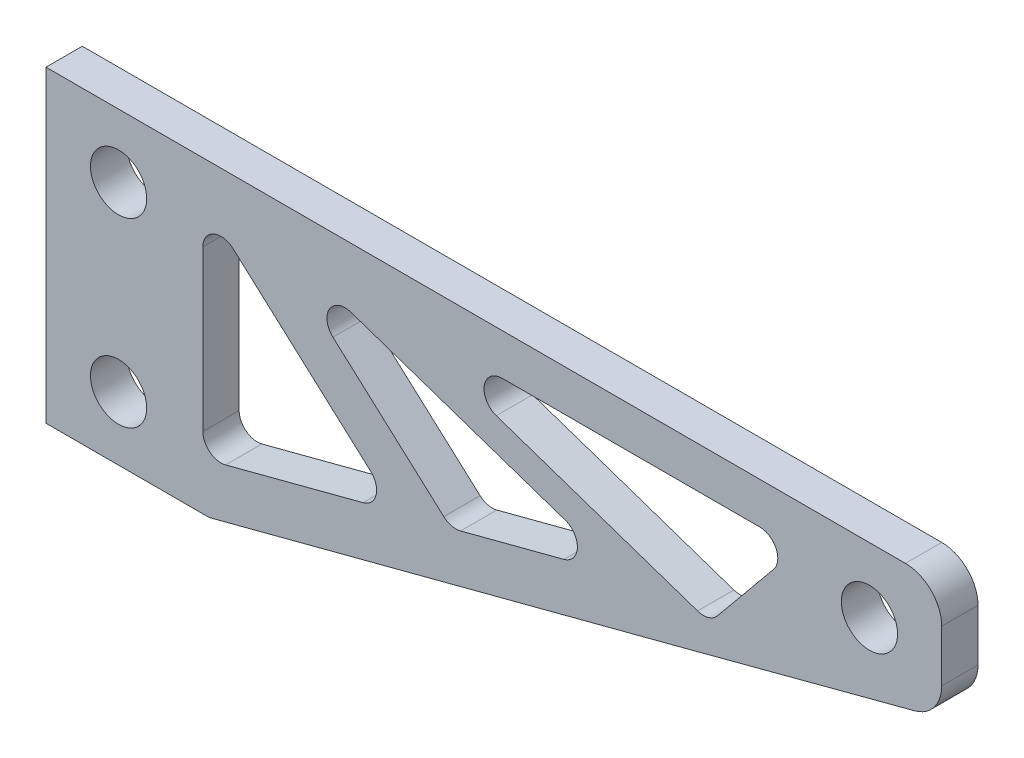
ISO-10303-21;
HEADER;
FILE_DESCRIPTION(('STEP AP214'),'2;1');
FILE_NAME('part.step','',(''),(''),'','','');
FILE_SCHEMA(('AUTOMOTIVE_DESIGN { 1 0 10303 214 1 1 1 1 }'));
ENDSEC;
DATA;
#1=APPLICATION_CONTEXT('core data for automotive mechanical design processes');
#2=APPLICATION_PROTOCOL_DEFINITION('international standard','automotive_design',2000,#1);
#3=PRODUCT_CONTEXT('',#1,'mechanical');
#4=PRODUCT('Part','Part','',(#3));
#5=PRODUCT_RELATED_PRODUCT_CATEGORY('part','',(#4));
#6=PRODUCT_DEFINITION_FORMATION('','',#4);
#7=PRODUCT_DEFINITION_CONTEXT('part definition',#1,'design');
#8=PRODUCT_DEFINITION('design','',#6,#7);
#9=PRODUCT_DEFINITION_SHAPE('','',#8);
#10=(LENGTH_UNIT() NAMED_UNIT(*) SI_UNIT(.MILLI.,.METRE.));
#11=(NAMED_UNIT(*) PLANE_ANGLE_UNIT() SI_UNIT($,.RADIAN.));
#12=(NAMED_UNIT(*) SI_UNIT($,.STERADIAN.) SOLID_ANGLE_UNIT());
#13=UNCERTAINTY_MEASURE_WITH_UNIT(LENGTH_MEASURE(1.E-05),#10,'distance_accuracy_value','');
#14=(GEOMETRIC_REPRESENTATION_CONTEXT(3) GLOBAL_UNCERTAINTY_ASSIGNED_CONTEXT((#13)) GLOBAL_UNIT_ASSIGNED_CONTEXT((#10,
#11,#12)) REPRESENTATION_CONTEXT('',''));
#15=CARTESIAN_POINT('',(0.,0.,0.));
#16=DIRECTION('',(0.,0.,1.));
#17=DIRECTION('',(1.,0.,0.));
#18=AXIS2_PLACEMENT_3D('',#15,#16,#17);
#19=CARTESIAN_POINT('',(42.8741564619006,5.14965167359102,2.));
#20=DIRECTION('',(0.,0.,-1.));
#21=DIRECTION('',(-1.,0.,0.));
#22=AXIS2_PLACEMENT_3D('',#19,#20,#21);
#23=PLANE('',#22);
#24=CARTESIAN_POINT('',(18.096822350734,0.252098862884251,2.));
#25=DIRECTION('',(0.,0.,1.));
#26=DIRECTION('',(1.,0.,0.));
#27=AXIS2_PLACEMENT_3D('',#24,#25,#26);
#28=CIRCLE('',#27,1.);
#29=CARTESIAN_POINT('',(17.4273653112307,-0.490751910999393,2.));
#30=VERTEX_POINT('',#29);
#31=CARTESIAN_POINT('',(18.3503103898361,-0.715239658023577,2.));
#32=VERTEX_POINT('',#31);
#33=EDGE_CURVE('E286',#30,#32,#28,.T.);
#34=ORIENTED_EDGE('',*,*,#33,.F.);
#35=DIRECTION('',(0.742850773883642,-0.669457039503264,0.));
#36=VECTOR('',#35,1.);
#37=CARTESIAN_POINT('',(11.3156214316606,5.0171510321832,2.));
#38=LINE('',#37,#36);
#39=CARTESIAN_POINT('',(11.3156214316606,5.01715103218319,2.));
#40=VERTEX_POINT('',#39);
#41=EDGE_CURVE('E303',#40,#30,#38,.T.);
#42=ORIENTED_EDGE('',*,*,#41,.F.);
#43=CARTESIAN_POINT('',(11.9850784711639,5.76000180606684,2.));
#44=DIRECTION('',(0.,0.,1.));
#45=DIRECTION('',(1.,0.,0.));
#46=AXIS2_PLACEMENT_3D('',#43,#44,#45);
#47=CIRCLE('',#46,1.);
#48=CARTESIAN_POINT('',(12.3070543121374,6.70674969110773,2.));
#49=VERTEX_POINT('',#48);
#50=EDGE_CURVE('E299',#49,#40,#47,.T.);
#51=ORIENTED_EDGE('',*,*,#50,.F.);
#52=DIRECTION('',(-0.946747885040891,0.321975840973511,0.));
#53=VECTOR('',#52,1.);
#54=CARTESIAN_POINT('',(24.1141900201502,2.69130639396048,2.));
#55=LINE('',#54,#53);
#56=CARTESIAN_POINT('',(24.1141900201502,2.69130639396048,2.));
#57=VERTEX_POINT('',#56);
#58=EDGE_CURVE('E296',#57,#49,#55,.T.);
#59=ORIENTED_EDGE('',*,*,#58,.F.);
#60=CARTESIAN_POINT('',(23.7922141791767,1.74455850891959,2.));
#61=DIRECTION('',(0.,0.,1.));
#62=DIRECTION('',(1.,0.,0.));
#63=AXIS2_PLACEMENT_3D('',#60,#61,#62);
#64=CIRCLE('',#63,1.);
#65=CARTESIAN_POINT('',(24.0457022182789,0.777219988011759,2.));
#66=VERTEX_POINT('',#65);
#67=EDGE_CURVE('E293',#66,#57,#64,.T.);
#68=ORIENTED_EDGE('',*,*,#67,.F.);
#69=DIRECTION('',(0.967338520907825,0.253488039102164,0.));
#70=VECTOR('',#69,1.);
#71=CARTESIAN_POINT('',(18.3503103898361,-0.715239658023577,2.));
#72=LINE('',#71,#70);
#73=EDGE_CURVE('E289',#32,#66,#72,.T.);
#74=ORIENTED_EDGE('',*,*,#73,.F.);
#75=EDGE_LOOP('',(#34,#42,#51,#59,#68,#74));
#76=FACE_BOUND('',#75,.T.);
#77=CARTESIAN_POINT('',(40.8905891871686,6.41133605295591,2.));
#78=DIRECTION('',(0.,0.,1.));
#79=DIRECTION('',(1.,0.,0.));
#80=AXIS2_PLACEMENT_3D('',#77,#78,#79);
#81=CIRCLE('',#80,1.55);
#82=CARTESIAN_POINT('',(42.4405891871686,6.41133605295591,2.));
#83=VERTEX_POINT('',#82);
#84=EDGE_CURVE('E412',#83,#83,#81,.T.);
#85=ORIENTED_EDGE('',*,*,#84,.F.);
#86=EDGE_LOOP('',(#85));
#87=FACE_BOUND('',#86,.T.);
#88=CARTESIAN_POINT('',(-0.499999999999998,6.5,2.));
#89=DIRECTION('',(0.,0.,1.));
#90=DIRECTION('',(-1.,0.,0.));
#91=AXIS2_PLACEMENT_3D('',#88,#89,#90);
#92=CIRCLE('',#91,1.55);
#93=CARTESIAN_POINT('',(-2.05,6.5,2.));
#94=VERTEX_POINT('',#93);
#95=EDGE_CURVE('E420',#94,#94,#92,.T.);
#96=ORIENTED_EDGE('',*,*,#95,.F.);
#97=EDGE_LOOP('',(#96));
#98=FACE_BOUND('',#97,.T.);
#99=CARTESIAN_POINT('',(-0.499999999999997,-3.5,2.));
#100=DIRECTION('',(0.,0.,1.));
#101=DIRECTION('',(1.,0.,0.));
#102=AXIS2_PLACEMENT_3D('',#99,#100,#101);
#103=CIRCLE('',#102,1.55);
#104=CARTESIAN_POINT('',(1.05,-3.5,2.));
#105=VERTEX_POINT('',#104);
#106=EDGE_CURVE('E428',#105,#105,#103,.T.);
#107=ORIENTED_EDGE('',*,*,#106,.F.);
#108=EDGE_LOOP('',(#107));
#109=FACE_BOUND('',#108,.T.);
#110=DIRECTION('',(0.,-1.,0.));
#111=VECTOR('',#110,1.);
#112=CARTESIAN_POINT('',(-4.5,10.,2.));
#113=LINE('',#112,#111);
#114=CARTESIAN_POINT('',(-4.5,10.,2.));
#115=VERTEX_POINT('',#114);
#116=CARTESIAN_POINT('',(-4.5,-7.,2.));
#117=VERTEX_POINT('',#116);
#118=EDGE_CURVE('E436',#115,#117,#113,.T.);
#119=ORIENTED_EDGE('',*,*,#118,.T.);
#120=DIRECTION('',(1.,0.,0.));
#121=VECTOR('',#120,1.);
#122=CARTESIAN_POINT('',(-4.5,-7.,2.));
#123=LINE('',#122,#121);
#124=CARTESIAN_POINT('',(4.50000000000001,-7.,2.));
#125=VERTEX_POINT('',#124);
#126=EDGE_CURVE('E440',#117,#125,#123,.T.);
#127=ORIENTED_EDGE('',*,*,#126,.T.);
#128=DIRECTION('',(0.967338520907825,0.253488039102165,0.));
#129=VECTOR('',#128,1.);
#130=CARTESIAN_POINT('',(4.50000000000001,-7.,2.));
#131=LINE('',#130,#129);
#132=CARTESIAN_POINT('',(31.2127777323871,0.,2.));
#133=VERTEX_POINT('',#132);
#134=EDGE_CURVE('E444',#125,#133,#131,.T.);
#135=ORIENTED_EDGE('',*,*,#134,.T.);
#136=DIRECTION('',(0.966824322874882,0.255442221837984,0.));
#137=VECTOR('',#136,1.);
#138=CARTESIAN_POINT('',(31.2127777323871,0.,2.));
#139=LINE('',#138,#137);
#140=CARTESIAN_POINT('',(43.3850409055766,3.21600302784125,2.));
#141=VERTEX_POINT('',#140);
#142=EDGE_CURVE('E447',#133,#141,#139,.T.);
#143=ORIENTED_EDGE('',*,*,#142,.T.);
#144=CARTESIAN_POINT('',(42.8741564619006,5.14965167359102,2.));
#145=DIRECTION('',(0.,0.,1.));
#146=DIRECTION('',(-1.,0.,0.));
#147=AXIS2_PLACEMENT_3D('',#144,#145,#146);
#148=CIRCLE('',#147,2.);
#149=CARTESIAN_POINT('',(44.8741564619006,5.14965167359102,2.));
#150=VERTEX_POINT('',#149);
#151=EDGE_CURVE('E450',#141,#150,#148,.T.);
#152=ORIENTED_EDGE('',*,*,#151,.T.);
#153=DIRECTION('',(0.,1.,0.));
#154=VECTOR('',#153,1.);
#155=CARTESIAN_POINT('',(44.8741564619006,8.,2.));
#156=LINE('',#155,#154);
#157=CARTESIAN_POINT('',(44.8741564619006,8.,2.));
#158=VERTEX_POINT('',#157);
#159=EDGE_CURVE('E453',#150,#158,#156,.T.);
#160=ORIENTED_EDGE('',*,*,#159,.T.);
#161=CARTESIAN_POINT('',(42.8741564619006,8.,2.));
#162=DIRECTION('',(0.,0.,1.));
#163=DIRECTION('',(1.,0.,0.));
#164=AXIS2_PLACEMENT_3D('',#161,#162,#163);
#165=CIRCLE('',#164,2.);
#166=CARTESIAN_POINT('',(42.8741564619006,10.,2.));
#167=VERTEX_POINT('',#166);
#168=EDGE_CURVE('E456',#158,#167,#165,.T.);
#169=ORIENTED_EDGE('',*,*,#168,.T.);
#170=DIRECTION('',(-1.,0.,0.));
#171=VECTOR('',#170,1.);
#172=CARTESIAN_POINT('',(4.5,10.,2.));
#173=LINE('',#172,#171);
#174=EDGE_CURVE('E459',#167,#115,#173,.T.);
#175=ORIENTED_EDGE('',*,*,#174,.T.);
#176=EDGE_LOOP('',(#119,#127,#135,#143,#152,#160,#169,#175));
#177=FACE_BOUND('',#176,.T.);
#178=CARTESIAN_POINT('',(31.739490278292,2.94677227113637,2.));
#179=DIRECTION('',(0.,0.,1.));
#180=DIRECTION('',(1.,0.,0.));
#181=AXIS2_PLACEMENT_3D('',#178,#179,#180);
#182=CIRCLE('',#181,0.999999999999999);
#183=CARTESIAN_POINT('',(31.4175144373185,2.00002438609548,2.));
#184=VERTEX_POINT('',#183);
#185=CARTESIAN_POINT('',(32.5122936708471,2.31212676657856,2.));
#186=VERTEX_POINT('',#185);
#187=EDGE_CURVE('E349',#184,#186,#182,.T.);
#188=ORIENTED_EDGE('',*,*,#187,.F.);
#189=DIRECTION('',(0.946747885040891,-0.32197584097351,0.));
#190=VECTOR('',#189,1.);
#191=CARTESIAN_POINT('',(20.3215878771777,5.77359530400396,2.));
#192=LINE('',#191,#190);
#193=CARTESIAN_POINT('',(20.3215878771777,5.77359530400396,2.));
#194=VERTEX_POINT('',#193);
#195=EDGE_CURVE('E366',#194,#184,#192,.T.);
#196=ORIENTED_EDGE('',*,*,#195,.F.);
#197=CARTESIAN_POINT('',(20.6435637181512,6.72034318904485,2.));
#198=DIRECTION('',(0.,0.,1.));
#199=DIRECTION('',(1.,0.,0.));
#200=AXIS2_PLACEMENT_3D('',#197,#198,#199);
#201=CIRCLE('',#200,1.);
#202=CARTESIAN_POINT('',(20.6435637181512,7.72034318904485,2.));
#203=VERTEX_POINT('',#202);
#204=EDGE_CURVE('E362',#203,#194,#201,.T.);
#205=ORIENTED_EDGE('',*,*,#204,.F.);
#206=DIRECTION('',(-1.,0.,0.));
#207=VECTOR('',#206,1.);
#208=CARTESIAN_POINT('',(34.8384412433788,7.72034318904485,2.));
#209=LINE('',#208,#207);
#210=CARTESIAN_POINT('',(34.8384412433788,7.72034318904485,2.));
#211=VERTEX_POINT('',#210);
#212=EDGE_CURVE('E359',#211,#203,#209,.T.);
#213=ORIENTED_EDGE('',*,*,#212,.F.);
#214=CARTESIAN_POINT('',(34.8384412433788,6.72034318904485,2.));
#215=DIRECTION('',(0.,0.,1.));
#216=DIRECTION('',(1.,0.,0.));
#217=AXIS2_PLACEMENT_3D('',#214,#215,#216);
#218=CIRCLE('',#217,0.999999999999998);
#219=CARTESIAN_POINT('',(35.6112446359338,6.08569768448704,2.));
#220=VERTEX_POINT('',#219);
#221=EDGE_CURVE('E356',#220,#211,#218,.T.);
#222=ORIENTED_EDGE('',*,*,#221,.F.);
#223=DIRECTION('',(0.634645504557812,0.772803392555028,0.));
#224=VECTOR('',#223,1.);
#225=CARTESIAN_POINT('',(32.5122936708471,2.31212676657856,2.));
#226=LINE('',#225,#224);
#227=EDGE_CURVE('E352',#186,#220,#226,.T.);
#228=ORIENTED_EDGE('',*,*,#227,.F.);
#229=EDGE_LOOP('',(#188,#196,#205,#213,#222,#228));
#230=FACE_BOUND('',#229,.T.);
#231=CARTESIAN_POINT('',(12.7242198609319,-1.0839637074037,2.));
#232=DIRECTION('',(0.,0.,1.));
#233=DIRECTION('',(1.,0.,0.));
#234=AXIS2_PLACEMENT_3D('',#231,#232,#233);
#235=CIRCLE('',#234,1.);
#236=CARTESIAN_POINT('',(12.9777079000341,-2.05130222831152,2.));
#237=VERTEX_POINT('',#236);
#238=CARTESIAN_POINT('',(13.3936769004352,-0.341112933520051,2.));
#239=VERTEX_POINT('',#238);
#240=EDGE_CURVE('E217',#237,#239,#235,.T.);
#241=ORIENTED_EDGE('',*,*,#240,.F.);
#242=DIRECTION('',(0.967338520907825,0.253488039102165,0.));
#243=VECTOR('',#242,1.);
#244=CARTESIAN_POINT('',(5.39999478244817,-4.03701829103269,2.));
#245=LINE('',#244,#243);
#246=CARTESIAN_POINT('',(5.39999478244817,-4.03701829103269,2.));
#247=VERTEX_POINT('',#246);
#248=EDGE_CURVE('E252',#247,#237,#245,.T.);
#249=ORIENTED_EDGE('',*,*,#248,.F.);
#250=CARTESIAN_POINT('',(5.146506743346,-3.06967977012486,2.));
#251=DIRECTION('',(0.,0.,1.));
#252=DIRECTION('',(1.,0.,0.));
#253=AXIS2_PLACEMENT_3D('',#250,#251,#252);
#254=CIRCLE('',#253,1.);
#255=CARTESIAN_POINT('',(4.146506743346,-3.06967977012486,2.));
#256=VERTEX_POINT('',#255);
#257=EDGE_CURVE('E249',#256,#247,#254,.T.);
#258=ORIENTED_EDGE('',*,*,#257,.F.);
#259=DIRECTION('',(0.,-1.,0.));
#260=VECTOR('',#259,1.);
#261=CARTESIAN_POINT('',(4.146506743346,5.7450705593072,2.));
#262=LINE('',#261,#260);
#263=CARTESIAN_POINT('',(4.146506743346,5.7450705593072,2.));
#264=VERTEX_POINT('',#263);
#265=EDGE_CURVE('E244',#264,#256,#262,.T.);
#266=ORIENTED_EDGE('',*,*,#265,.F.);
#267=CARTESIAN_POINT('',(5.146506743346,5.74507055930722,2.));
#268=DIRECTION('',(0.,0.,1.));
#269=DIRECTION('',(1.,0.,0.));
#270=AXIS2_PLACEMENT_3D('',#267,#268,#269);
#271=CIRCLE('',#270,1.);
#272=CARTESIAN_POINT('',(5.81596378284927,6.48792133319086,2.));
#273=VERTEX_POINT('',#272);
#274=EDGE_CURVE('E240',#273,#264,#271,.T.);
#275=ORIENTED_EDGE('',*,*,#274,.F.);
#276=DIRECTION('',(-0.742850773883641,0.669457039503264,0.));
#277=VECTOR('',#276,1.);
#278=CARTESIAN_POINT('',(13.3936769004352,-0.341112933520051,2.));
#279=LINE('',#278,#277);
#280=EDGE_CURVE('E226',#239,#273,#279,.T.);
#281=ORIENTED_EDGE('',*,*,#280,.F.);
#282=EDGE_LOOP('',(#241,#249,#258,#266,#275,#281));
#283=FACE_BOUND('',#282,.T.);
#284=ADVANCED_FACE('F43',(#76,#87,#98,#109,#177,#230,#283),#23,.F.);
#285=CARTESIAN_POINT('',(42.8741564619006,5.14965167359102,0.));
#286=DIRECTION('',(0.,0.,-1.));
#287=DIRECTION('',(-1.,0.,0.));
#288=AXIS2_PLACEMENT_3D('',#285,#286,#287);
#289=PLANE('',#288);
#290=CARTESIAN_POINT('',(-0.499999999999998,6.5,0.));
#291=DIRECTION('',(0.,0.,1.));
#292=DIRECTION('',(-1.,0.,0.));
#293=AXIS2_PLACEMENT_3D('',#290,#291,#292);
#294=CIRCLE('',#293,1.55);
#295=CARTESIAN_POINT('',(-2.05,6.5,0.));
#296=VERTEX_POINT('',#295);
#297=EDGE_CURVE('E416',#296,#296,#294,.T.);
#298=ORIENTED_EDGE('',*,*,#297,.T.);
#299=EDGE_LOOP('',(#298));
#300=FACE_BOUND('',#299,.T.);
#301=DIRECTION('',(0.,-1.,0.));
#302=VECTOR('',#301,1.);
#303=CARTESIAN_POINT('',(-4.5,10.,0.));
#304=LINE('',#303,#302);
#305=CARTESIAN_POINT('',(-4.5,10.,0.));
#306=VERTEX_POINT('',#305);
#307=CARTESIAN_POINT('',(-4.5,-7.,0.));
#308=VERTEX_POINT('',#307);
#309=EDGE_CURVE('E432',#306,#308,#304,.T.);
#310=ORIENTED_EDGE('',*,*,#309,.F.);
#311=DIRECTION('',(-1.,0.,0.));
#312=VECTOR('',#311,1.);
#313=CARTESIAN_POINT('',(-4.5,10.,0.));
#314=LINE('',#313,#312);
#315=CARTESIAN_POINT('',(42.8741564619006,10.,0.));
#316=VERTEX_POINT('',#315);
#317=EDGE_CURVE('E441',#316,#306,#314,.T.);
#318=ORIENTED_EDGE('',*,*,#317,.F.);
#319=CARTESIAN_POINT('',(42.8741564619006,8.,0.));
#320=DIRECTION('',(0.,0.,1.));
#321=DIRECTION('',(1.,0.,0.));
#322=AXIS2_PLACEMENT_3D('',#319,#320,#321);
#323=CIRCLE('',#322,2.);
#324=CARTESIAN_POINT('',(44.8741564619006,8.,0.));
#325=VERTEX_POINT('',#324);
#326=EDGE_CURVE('E481',#325,#316,#323,.T.);
#327=ORIENTED_EDGE('',*,*,#326,.F.);
#328=DIRECTION('',(0.,1.,0.));
#329=VECTOR('',#328,1.);
#330=CARTESIAN_POINT('',(44.8741564619006,8.,0.));
#331=LINE('',#330,#329);
#332=CARTESIAN_POINT('',(44.8741564619006,5.14965167359102,0.));
#333=VERTEX_POINT('',#332);
#334=EDGE_CURVE('E478',#333,#325,#331,.T.);
#335=ORIENTED_EDGE('',*,*,#334,.F.);
#336=CARTESIAN_POINT('',(42.8741564619006,5.14965167359102,0.));
#337=DIRECTION('',(0.,0.,1.));
#338=DIRECTION('',(-1.,0.,0.));
#339=AXIS2_PLACEMENT_3D('',#336,#337,#338);
#340=CIRCLE('',#339,2.);
#341=CARTESIAN_POINT('',(43.3850409055766,3.21600302784125,0.));
#342=VERTEX_POINT('',#341);
#343=EDGE_CURVE('E475',#342,#333,#340,.T.);
#344=ORIENTED_EDGE('',*,*,#343,.F.);
#345=DIRECTION('',(0.966824322874882,0.255442221837984,0.));
#346=VECTOR('',#345,1.);
#347=CARTESIAN_POINT('',(31.2127777323871,0.,0.));
#348=LINE('',#347,#346);
#349=CARTESIAN_POINT('',(31.2127777323871,0.,0.));
#350=VERTEX_POINT('',#349);
#351=EDGE_CURVE('E472',#350,#342,#348,.T.);
#352=ORIENTED_EDGE('',*,*,#351,.F.);
#353=DIRECTION('',(0.967338520907825,0.253488039102165,0.));
#354=VECTOR('',#353,1.);
#355=CARTESIAN_POINT('',(4.50000000000001,-7.,0.));
#356=LINE('',#355,#354);
#357=CARTESIAN_POINT('',(4.50000000000001,-7.,0.));
#358=VERTEX_POINT('',#357);
#359=EDGE_CURVE('E469',#358,#350,#356,.T.);
#360=ORIENTED_EDGE('',*,*,#359,.F.);
#361=DIRECTION('',(1.,0.,0.));
#362=VECTOR('',#361,1.);
#363=CARTESIAN_POINT('',(-4.5,-7.,0.));
#364=LINE('',#363,#362);
#365=EDGE_CURVE('E466',#308,#358,#364,.T.);
#366=ORIENTED_EDGE('',*,*,#365,.F.);
#367=EDGE_LOOP('',(#310,#318,#327,#335,#344,#352,#360,#366));
#368=FACE_BOUND('',#367,.T.);
#369=CARTESIAN_POINT('',(-0.499999999999997,-3.5,0.));
#370=DIRECTION('',(0.,0.,1.));
#371=DIRECTION('',(1.,0.,0.));
#372=AXIS2_PLACEMENT_3D('',#369,#370,#371);
#373=CIRCLE('',#372,1.55);
#374=CARTESIAN_POINT('',(1.05,-3.5,0.));
#375=VERTEX_POINT('',#374);
#376=EDGE_CURVE('E424',#375,#375,#373,.T.);
#377=ORIENTED_EDGE('',*,*,#376,.T.);
#378=EDGE_LOOP('',(#377));
#379=FACE_BOUND('',#378,.T.);
#380=CARTESIAN_POINT('',(40.8905891871686,6.41133605295591,0.));
#381=DIRECTION('',(0.,0.,1.));
#382=DIRECTION('',(1.,0.,0.));
#383=AXIS2_PLACEMENT_3D('',#380,#381,#382);
#384=CIRCLE('',#383,1.55);
#385=CARTESIAN_POINT('',(42.4405891871686,6.41133605295591,0.));
#386=VERTEX_POINT('',#385);
#387=EDGE_CURVE('E411',#386,#386,#384,.T.);
#388=ORIENTED_EDGE('',*,*,#387,.T.);
#389=EDGE_LOOP('',(#388));
#390=FACE_BOUND('',#389,.T.);
#391=DIRECTION('',(0.946747885040891,-0.32197584097351,0.));
#392=VECTOR('',#391,1.);
#393=CARTESIAN_POINT('',(20.3215878771777,5.77359530400396,0.));
#394=LINE('',#393,#392);
#395=CARTESIAN_POINT('',(20.3215878771777,5.77359530400396,0.));
#396=VERTEX_POINT('',#395);
#397=CARTESIAN_POINT('',(31.4175144373185,2.00002438609548,0.));
#398=VERTEX_POINT('',#397);
#399=EDGE_CURVE('E353',#396,#398,#394,.T.);
#400=ORIENTED_EDGE('',*,*,#399,.T.);
#401=CARTESIAN_POINT('',(31.739490278292,2.94677227113637,0.));
#402=DIRECTION('',(0.,0.,1.));
#403=DIRECTION('',(1.,0.,0.));
#404=AXIS2_PLACEMENT_3D('',#401,#402,#403);
#405=CIRCLE('',#404,0.999999999999999);
#406=CARTESIAN_POINT('',(32.5122936708471,2.31212676657856,0.));
#407=VERTEX_POINT('',#406);
#408=EDGE_CURVE('E348',#398,#407,#405,.T.);
#409=ORIENTED_EDGE('',*,*,#408,.T.);
#410=DIRECTION('',(0.634645504557812,0.772803392555028,0.));
#411=VECTOR('',#410,1.);
#412=CARTESIAN_POINT('',(32.5122936708471,2.31212676657856,0.));
#413=LINE('',#412,#411);
#414=CARTESIAN_POINT('',(35.6112446359338,6.08569768448704,0.));
#415=VERTEX_POINT('',#414);
#416=EDGE_CURVE('E373',#407,#415,#413,.T.);
#417=ORIENTED_EDGE('',*,*,#416,.T.);
#418=CARTESIAN_POINT('',(34.8384412433788,6.72034318904485,0.));
#419=DIRECTION('',(0.,0.,1.));
#420=DIRECTION('',(1.,0.,0.));
#421=AXIS2_PLACEMENT_3D('',#418,#419,#420);
#422=CIRCLE('',#421,0.999999999999998);
#423=CARTESIAN_POINT('',(34.8384412433788,7.72034318904485,0.));
#424=VERTEX_POINT('',#423);
#425=EDGE_CURVE('E377',#415,#424,#422,.T.);
#426=ORIENTED_EDGE('',*,*,#425,.T.);
#427=DIRECTION('',(-1.,0.,0.));
#428=VECTOR('',#427,1.);
#429=CARTESIAN_POINT('',(34.8384412433788,7.72034318904485,0.));
#430=LINE('',#429,#428);
#431=CARTESIAN_POINT('',(20.6435637181512,7.72034318904485,0.));
#432=VERTEX_POINT('',#431);
#433=EDGE_CURVE('E381',#424,#432,#430,.T.);
#434=ORIENTED_EDGE('',*,*,#433,.T.);
#435=CARTESIAN_POINT('',(20.6435637181512,6.72034318904485,0.));
#436=DIRECTION('',(0.,0.,1.));
#437=DIRECTION('',(1.,0.,0.));
#438=AXIS2_PLACEMENT_3D('',#435,#436,#437);
#439=CIRCLE('',#438,1.);
#440=EDGE_CURVE('E385',#432,#396,#439,.T.);
#441=ORIENTED_EDGE('',*,*,#440,.T.);
#442=EDGE_LOOP('',(#400,#409,#417,#426,#434,#441));
#443=FACE_BOUND('',#442,.T.);
#444=DIRECTION('',(0.742850773883642,-0.669457039503264,0.));
#445=VECTOR('',#444,1.);
#446=CARTESIAN_POINT('',(11.3156214316606,5.0171510321832,0.));
#447=LINE('',#446,#445);
#448=CARTESIAN_POINT('',(11.3156214316606,5.0171510321832,0.));
#449=VERTEX_POINT('',#448);
#450=CARTESIAN_POINT('',(17.4273653112307,-0.490751910999404,0.));
#451=VERTEX_POINT('',#450);
#452=EDGE_CURVE('E290',#449,#451,#447,.T.);
#453=ORIENTED_EDGE('',*,*,#452,.T.);
#454=CARTESIAN_POINT('',(18.096822350734,0.252098862884251,0.));
#455=DIRECTION('',(0.,0.,1.));
#456=DIRECTION('',(1.,0.,0.));
#457=AXIS2_PLACEMENT_3D('',#454,#455,#456);
#458=CIRCLE('',#457,1.);
#459=CARTESIAN_POINT('',(18.3503103898361,-0.715239658023577,0.));
#460=VERTEX_POINT('',#459);
#461=EDGE_CURVE('E235',#451,#460,#458,.T.);
#462=ORIENTED_EDGE('',*,*,#461,.T.);
#463=DIRECTION('',(0.967338520907825,0.253488039102164,0.));
#464=VECTOR('',#463,1.);
#465=CARTESIAN_POINT('',(18.3503103898361,-0.715239658023577,0.));
#466=LINE('',#465,#464);
#467=CARTESIAN_POINT('',(24.0457022182789,0.777219988011759,0.));
#468=VERTEX_POINT('',#467);
#469=EDGE_CURVE('E310',#460,#468,#466,.T.);
#470=ORIENTED_EDGE('',*,*,#469,.T.);
#471=CARTESIAN_POINT('',(23.7922141791767,1.74455850891959,0.));
#472=DIRECTION('',(0.,0.,1.));
#473=DIRECTION('',(1.,0.,0.));
#474=AXIS2_PLACEMENT_3D('',#471,#472,#473);
#475=CIRCLE('',#474,1.);
#476=CARTESIAN_POINT('',(24.1141900201502,2.69130639396048,0.));
#477=VERTEX_POINT('',#476);
#478=EDGE_CURVE('E314',#468,#477,#475,.T.);
#479=ORIENTED_EDGE('',*,*,#478,.T.);
#480=DIRECTION('',(-0.946747885040891,0.321975840973511,0.));
#481=VECTOR('',#480,1.);
#482=CARTESIAN_POINT('',(24.1141900201502,2.69130639396048,0.));
#483=LINE('',#482,#481);
#484=CARTESIAN_POINT('',(12.3070543121374,6.70674969110773,0.));
#485=VERTEX_POINT('',#484);
#486=EDGE_CURVE('E318',#477,#485,#483,.T.);
#487=ORIENTED_EDGE('',*,*,#486,.T.);
#488=CARTESIAN_POINT('',(11.9850784711639,5.76000180606684,0.));
#489=DIRECTION('',(0.,0.,1.));
#490=DIRECTION('',(1.,0.,0.));
#491=AXIS2_PLACEMENT_3D('',#488,#489,#490);
#492=CIRCLE('',#491,1.);
#493=EDGE_CURVE('E322',#485,#449,#492,.T.);
#494=ORIENTED_EDGE('',*,*,#493,.T.);
#495=EDGE_LOOP('',(#453,#462,#470,#479,#487,#494));
#496=FACE_BOUND('',#495,.T.);
#497=DIRECTION('',(0.967338520907825,0.253488039102165,0.));
#498=VECTOR('',#497,1.);
#499=CARTESIAN_POINT('',(5.39999478244817,-4.03701829103269,0.));
#500=LINE('',#499,#498);
#501=CARTESIAN_POINT('',(5.39999478244817,-4.03701829103269,0.));
#502=VERTEX_POINT('',#501);
#503=CARTESIAN_POINT('',(12.9777079000341,-2.05130222831152,0.));
#504=VERTEX_POINT('',#503);
#505=EDGE_CURVE('E227',#502,#504,#500,.T.);
#506=ORIENTED_EDGE('',*,*,#505,.T.);
#507=CARTESIAN_POINT('',(12.7242198609319,-1.0839637074037,0.));
#508=DIRECTION('',(0.,0.,1.));
#509=DIRECTION('',(1.,0.,0.));
#510=AXIS2_PLACEMENT_3D('',#507,#508,#509);
#511=CIRCLE('',#510,1.);
#512=CARTESIAN_POINT('',(13.3936769004352,-0.341112933520051,0.));
#513=VERTEX_POINT('',#512);
#514=EDGE_CURVE('E67',#504,#513,#511,.T.);
#515=ORIENTED_EDGE('',*,*,#514,.T.);
#516=DIRECTION('',(-0.742850773883641,0.669457039503264,0.));
#517=VECTOR('',#516,1.);
#518=CARTESIAN_POINT('',(13.3936769004352,-0.341112933520051,0.));
#519=LINE('',#518,#517);
#520=CARTESIAN_POINT('',(5.81596378284927,6.48792133319086,0.));
#521=VERTEX_POINT('',#520);
#522=EDGE_CURVE('E233',#513,#521,#519,.T.);
#523=ORIENTED_EDGE('',*,*,#522,.T.);
#524=CARTESIAN_POINT('',(5.146506743346,5.74507055930722,0.));
#525=DIRECTION('',(0.,0.,1.));
#526=DIRECTION('',(1.,0.,0.));
#527=AXIS2_PLACEMENT_3D('',#524,#525,#526);
#528=CIRCLE('',#527,1.);
#529=CARTESIAN_POINT('',(4.146506743346,5.7450705593072,0.));
#530=VERTEX_POINT('',#529);
#531=EDGE_CURVE('E259',#521,#530,#528,.T.);
#532=ORIENTED_EDGE('',*,*,#531,.T.);
#533=DIRECTION('',(0.,-1.,0.));
#534=VECTOR('',#533,1.);
#535=CARTESIAN_POINT('',(4.146506743346,5.7450705593072,0.));
#536=LINE('',#535,#534);
#537=CARTESIAN_POINT('',(4.146506743346,-3.06967977012486,0.));
#538=VERTEX_POINT('',#537);
#539=EDGE_CURVE('E263',#530,#538,#536,.T.);
#540=ORIENTED_EDGE('',*,*,#539,.T.);
#541=CARTESIAN_POINT('',(5.146506743346,-3.06967977012486,0.));
#542=DIRECTION('',(0.,0.,1.));
#543=DIRECTION('',(1.,0.,0.));
#544=AXIS2_PLACEMENT_3D('',#541,#542,#543);
#545=CIRCLE('',#544,1.);
#546=EDGE_CURVE('E267',#538,#502,#545,.T.);
#547=ORIENTED_EDGE('',*,*,#546,.T.);
#548=EDGE_LOOP('',(#506,#515,#523,#532,#540,#547));
#549=FACE_BOUND('',#548,.T.);
#550=ADVANCED_FACE('F521',(#300,#368,#379,#390,#443,#496,#549),#289,.T.);
#551=CARTESIAN_POINT('',(-4.5,10.,2.));
#552=DIRECTION('',(1.,0.,0.));
#553=DIRECTION('',(0.,1.,0.));
#554=AXIS2_PLACEMENT_3D('',#551,#552,#553);
#555=PLANE('',#554);
#556=ORIENTED_EDGE('',*,*,#309,.T.);
#557=DIRECTION('',(0.,0.,-1.));
#558=VECTOR('',#557,1.);
#559=CARTESIAN_POINT('',(-4.5,-7.,2.));
#560=LINE('',#559,#558);
#561=EDGE_CURVE('E11',#117,#308,#560,.T.);
#562=ORIENTED_EDGE('',*,*,#561,.F.);
#563=ORIENTED_EDGE('',*,*,#118,.F.);
#564=DIRECTION('',(0.,0.,-1.));
#565=VECTOR('',#564,1.);
#566=CARTESIAN_POINT('',(-4.5,10.,2.));
#567=LINE('',#566,#565);
#568=EDGE_CURVE('E462',#115,#306,#567,.T.);
#569=ORIENTED_EDGE('',*,*,#568,.T.);
#570=EDGE_LOOP('',(#556,#562,#563,#569));
#571=FACE_BOUND('',#570,.T.);
#572=ADVANCED_FACE('F45',(#571),#555,.F.);
#573=CARTESIAN_POINT('',(-4.5,-7.,2.));
#574=DIRECTION('',(0.,1.,0.));
#575=DIRECTION('',(0.,0.,1.));
#576=AXIS2_PLACEMENT_3D('',#573,#574,#575);
#577=PLANE('',#576);
#578=ORIENTED_EDGE('',*,*,#365,.T.);
#579=DIRECTION('',(0.,0.,-1.));
#580=VECTOR('',#579,1.);
#581=CARTESIAN_POINT('',(4.50000000000001,-7.,2.));
#582=LINE('',#581,#580);
#583=EDGE_CURVE('E52',#125,#358,#582,.T.);
#584=ORIENTED_EDGE('',*,*,#583,.F.);
#585=ORIENTED_EDGE('',*,*,#126,.F.);
#586=ORIENTED_EDGE('',*,*,#561,.T.);
#587=EDGE_LOOP('',(#578,#584,#585,#586));
#588=FACE_BOUND('',#587,.T.);
#589=ADVANCED_FACE('F539',(#588),#577,.F.);
#590=CARTESIAN_POINT('',(4.50000000000001,-7.,2.));
#591=DIRECTION('',(-0.253488039102165,0.967338520907825,0.));
#592=DIRECTION('',(-0.967338520907825,-0.253488039102165,0.));
#593=AXIS2_PLACEMENT_3D('',#590,#591,#592);
#594=PLANE('',#593);
#595=ORIENTED_EDGE('',*,*,#359,.T.);
#596=DIRECTION('',(0.,0.,-1.));
#597=VECTOR('',#596,1.);
#598=CARTESIAN_POINT('',(31.2127777323871,0.,2.));
#599=LINE('',#598,#597);
#600=EDGE_CURVE('E506',#133,#350,#599,.T.);
#601=ORIENTED_EDGE('',*,*,#600,.F.);
#602=ORIENTED_EDGE('',*,*,#134,.F.);
#603=ORIENTED_EDGE('',*,*,#583,.T.);
#604=EDGE_LOOP('',(#595,#601,#602,#603));
#605=FACE_BOUND('',#604,.T.);
#606=ADVANCED_FACE('F515',(#605),#594,.F.);
#607=CARTESIAN_POINT('',(31.2127777323871,0.,2.));
#608=DIRECTION('',(-0.255442221837984,0.966824322874882,0.));
#609=DIRECTION('',(-0.966824322874882,-0.255442221837984,0.));
#610=AXIS2_PLACEMENT_3D('',#607,#608,#609);
#611=PLANE('',#610);
#612=ORIENTED_EDGE('',*,*,#351,.T.);
#613=DIRECTION('',(0.,0.,-1.));
#614=VECTOR('',#613,1.);
#615=CARTESIAN_POINT('',(43.3850409055766,3.21600302784125,2.));
#616=LINE('',#615,#614);
#617=EDGE_CURVE('E502',#141,#342,#616,.T.);
#618=ORIENTED_EDGE('',*,*,#617,.F.);
#619=ORIENTED_EDGE('',*,*,#142,.F.);
#620=ORIENTED_EDGE('',*,*,#600,.T.);
#621=EDGE_LOOP('',(#612,#618,#619,#620));
#622=FACE_BOUND('',#621,.T.);
#623=ADVANCED_FACE('F527',(#622),#611,.F.);
#624=CARTESIAN_POINT('',(42.8741564619006,5.14965167359102,2.));
#625=DIRECTION('',(0.,0.,-1.));
#626=DIRECTION('',(-1.,0.,0.));
#627=AXIS2_PLACEMENT_3D('',#624,#625,#626);
#628=CYLINDRICAL_SURFACE('',#627,2.);
#629=ORIENTED_EDGE('',*,*,#343,.T.);
#630=DIRECTION('',(0.,0.,-1.));
#631=VECTOR('',#630,1.);
#632=CARTESIAN_POINT('',(44.8741564619006,5.14965167359102,2.));
#633=LINE('',#632,#631);
#634=EDGE_CURVE('E498',#150,#333,#633,.T.);
#635=ORIENTED_EDGE('',*,*,#634,.F.);
#636=ORIENTED_EDGE('',*,*,#151,.F.);
#637=ORIENTED_EDGE('',*,*,#617,.T.);
#638=EDGE_LOOP('',(#629,#635,#636,#637));
#639=FACE_BOUND('',#638,.T.);
#640=ADVANCED_FACE('F531',(#639),#628,.T.);
#641=CARTESIAN_POINT('',(44.8741564619006,8.,2.));
#642=DIRECTION('',(-1.,0.,0.));
#643=DIRECTION('',(0.,0.,1.));
#644=AXIS2_PLACEMENT_3D('',#641,#642,#643);
#645=PLANE('',#644);
#646=ORIENTED_EDGE('',*,*,#334,.T.);
#647=DIRECTION('',(0.,0.,-1.));
#648=VECTOR('',#647,1.);
#649=CARTESIAN_POINT('',(44.8741564619006,8.,2.));
#650=LINE('',#649,#648);
#651=EDGE_CURVE('E494',#158,#325,#650,.T.);
#652=ORIENTED_EDGE('',*,*,#651,.F.);
#653=ORIENTED_EDGE('',*,*,#159,.F.);
#654=ORIENTED_EDGE('',*,*,#634,.T.);
#655=EDGE_LOOP('',(#646,#652,#653,#654));
#656=FACE_BOUND('',#655,.T.);
#657=ADVANCED_FACE('F560',(#656),#645,.F.);
#658=CARTESIAN_POINT('',(42.8741564619006,8.,2.));
#659=DIRECTION('',(0.,0.,-1.));
#660=DIRECTION('',(-1.,0.,0.));
#661=AXIS2_PLACEMENT_3D('',#658,#659,#660);
#662=CYLINDRICAL_SURFACE('',#661,2.);
#663=ORIENTED_EDGE('',*,*,#326,.T.);
#664=DIRECTION('',(0.,0.,-1.));
#665=VECTOR('',#664,1.);
#666=CARTESIAN_POINT('',(42.8741564619006,10.,2.));
#667=LINE('',#666,#665);
#668=EDGE_CURVE('E490',#167,#316,#667,.T.);
#669=ORIENTED_EDGE('',*,*,#668,.F.);
#670=ORIENTED_EDGE('',*,*,#168,.F.);
#671=ORIENTED_EDGE('',*,*,#651,.T.);
#672=EDGE_LOOP('',(#663,#669,#670,#671));
#673=FACE_BOUND('',#672,.T.);
#674=ADVANCED_FACE('F546',(#673),#662,.T.);
#675=CARTESIAN_POINT('',(-4.5,10.,2.));
#676=DIRECTION('',(0.,-1.,0.));
#677=DIRECTION('',(0.,0.,-1.));
#678=AXIS2_PLACEMENT_3D('',#675,#676,#677);
#679=PLANE('',#678);
#680=ORIENTED_EDGE('',*,*,#317,.T.);
#681=ORIENTED_EDGE('',*,*,#568,.F.);
#682=ORIENTED_EDGE('',*,*,#174,.F.);
#683=ORIENTED_EDGE('',*,*,#668,.T.);
#684=EDGE_LOOP('',(#680,#681,#682,#683));
#685=FACE_BOUND('',#684,.T.);
#686=ADVANCED_FACE('F549',(#685),#679,.F.);
#687=CARTESIAN_POINT('',(-0.499999999999997,-3.5,2.));
#688=DIRECTION('',(0.,0.,-1.));
#689=DIRECTION('',(-1.,0.,0.));
#690=AXIS2_PLACEMENT_3D('',#687,#688,#689);
#691=CYLINDRICAL_SURFACE('',#690,1.55);
#692=ORIENTED_EDGE('',*,*,#106,.T.);
#693=EDGE_LOOP('',(#692));
#694=FACE_BOUND('',#693,.T.);
#695=ORIENTED_EDGE('',*,*,#376,.F.);
#696=EDGE_LOOP('',(#695));
#697=FACE_BOUND('',#696,.T.);
#698=ADVANCED_FACE('F551',(#694,#697),#691,.F.);
#699=CARTESIAN_POINT('',(-0.499999999999998,6.5,2.));
#700=DIRECTION('',(0.,0.,-1.));
#701=DIRECTION('',(-1.,0.,0.));
#702=AXIS2_PLACEMENT_3D('',#699,#700,#701);
#703=CYLINDRICAL_SURFACE('',#702,1.55);
#704=ORIENTED_EDGE('',*,*,#95,.T.);
#705=EDGE_LOOP('',(#704));
#706=FACE_BOUND('',#705,.T.);
#707=ORIENTED_EDGE('',*,*,#297,.F.);
#708=EDGE_LOOP('',(#707));
#709=FACE_BOUND('',#708,.T.);
#710=ADVANCED_FACE('F557',(#706,#709),#703,.F.);
#711=CARTESIAN_POINT('',(40.8905891871686,6.41133605295591,2.));
#712=DIRECTION('',(0.,0.,-1.));
#713=DIRECTION('',(-1.,0.,0.));
#714=AXIS2_PLACEMENT_3D('',#711,#712,#713);
#715=CYLINDRICAL_SURFACE('',#714,1.55);
#716=ORIENTED_EDGE('',*,*,#84,.T.);
#717=EDGE_LOOP('',(#716));
#718=FACE_BOUND('',#717,.T.);
#719=ORIENTED_EDGE('',*,*,#387,.F.);
#720=EDGE_LOOP('',(#719));
#721=FACE_BOUND('',#720,.T.);
#722=ADVANCED_FACE('F575',(#718,#721),#715,.F.);
#723=CARTESIAN_POINT('',(31.739490278292,2.94677227113637,2.));
#724=DIRECTION('',(0.,0.,-1.));
#725=DIRECTION('',(-1.,0.,0.));
#726=AXIS2_PLACEMENT_3D('',#723,#724,#725);
#727=CYLINDRICAL_SURFACE('',#726,0.999999999999999);
#728=ORIENTED_EDGE('',*,*,#408,.F.);
#729=DIRECTION('',(0.,0.,-1.));
#730=VECTOR('',#729,1.);
#731=CARTESIAN_POINT('',(31.4175144373185,2.00002438609548,2.));
#732=LINE('',#731,#730);
#733=EDGE_CURVE('E369',#184,#398,#732,.T.);
#734=ORIENTED_EDGE('',*,*,#733,.F.);
#735=ORIENTED_EDGE('',*,*,#187,.T.);
#736=DIRECTION('',(0.,0.,-1.));
#737=VECTOR('',#736,1.);
#738=CARTESIAN_POINT('',(32.5122936708471,2.31212676657856,2.));
#739=LINE('',#738,#737);
#740=EDGE_CURVE('E407',#186,#407,#739,.T.);
#741=ORIENTED_EDGE('',*,*,#740,.T.);
#742=EDGE_LOOP('',(#728,#734,#735,#741));
#743=FACE_BOUND('',#742,.T.);
#744=ADVANCED_FACE('F579',(#743),#727,.F.);
#745=CARTESIAN_POINT('',(32.5122936708471,2.31212676657856,2.));
#746=DIRECTION('',(-0.772803392555028,0.634645504557812,0.));
#747=DIRECTION('',(-0.634645504557812,-0.772803392555028,0.));
#748=AXIS2_PLACEMENT_3D('',#745,#746,#747);
#749=PLANE('',#748);
#750=ORIENTED_EDGE('',*,*,#416,.F.);
#751=ORIENTED_EDGE('',*,*,#740,.F.);
#752=ORIENTED_EDGE('',*,*,#227,.T.);
#753=DIRECTION('',(0.,0.,-1.));
#754=VECTOR('',#753,1.);
#755=CARTESIAN_POINT('',(35.6112446359338,6.08569768448704,2.));
#756=LINE('',#755,#754);
#757=EDGE_CURVE('E404',#220,#415,#756,.T.);
#758=ORIENTED_EDGE('',*,*,#757,.T.);
#759=EDGE_LOOP('',(#750,#751,#752,#758));
#760=FACE_BOUND('',#759,.T.);
#761=ADVANCED_FACE('F583',(#760),#749,.T.);
#762=CARTESIAN_POINT('',(34.8384412433788,6.72034318904485,2.));
#763=DIRECTION('',(0.,0.,-1.));
#764=DIRECTION('',(-1.,0.,0.));
#765=AXIS2_PLACEMENT_3D('',#762,#763,#764);
#766=CYLINDRICAL_SURFACE('',#765,0.999999999999998);
#767=ORIENTED_EDGE('',*,*,#425,.F.);
#768=ORIENTED_EDGE('',*,*,#757,.F.);
#769=ORIENTED_EDGE('',*,*,#221,.T.);
#770=DIRECTION('',(0.,0.,-1.));
#771=VECTOR('',#770,1.);
#772=CARTESIAN_POINT('',(34.8384412433788,7.72034318904485,2.));
#773=LINE('',#772,#771);
#774=EDGE_CURVE('E401',#211,#424,#773,.T.);
#775=ORIENTED_EDGE('',*,*,#774,.T.);
#776=EDGE_LOOP('',(#767,#768,#769,#775));
#777=FACE_BOUND('',#776,.T.);
#778=ADVANCED_FACE('F587',(#777),#766,.F.);
#779=CARTESIAN_POINT('',(34.8384412433788,7.72034318904485,2.));
#780=DIRECTION('',(0.,-1.,0.));
#781=DIRECTION('',(0.,0.,-1.));
#782=AXIS2_PLACEMENT_3D('',#779,#780,#781);
#783=PLANE('',#782);
#784=ORIENTED_EDGE('',*,*,#433,.F.);
#785=ORIENTED_EDGE('',*,*,#774,.F.);
#786=ORIENTED_EDGE('',*,*,#212,.T.);
#787=DIRECTION('',(0.,0.,-1.));
#788=VECTOR('',#787,1.);
#789=CARTESIAN_POINT('',(20.6435637181512,7.72034318904485,2.));
#790=LINE('',#789,#788);
#791=EDGE_CURVE('E398',#203,#432,#790,.T.);
#792=ORIENTED_EDGE('',*,*,#791,.T.);
#793=EDGE_LOOP('',(#784,#785,#786,#792));
#794=FACE_BOUND('',#793,.T.);
#795=ADVANCED_FACE('F591',(#794),#783,.T.);
#796=CARTESIAN_POINT('',(20.6435637181512,6.72034318904485,2.));
#797=DIRECTION('',(0.,0.,-1.));
#798=DIRECTION('',(-1.,0.,0.));
#799=AXIS2_PLACEMENT_3D('',#796,#797,#798);
#800=CYLINDRICAL_SURFACE('',#799,1.);
#801=ORIENTED_EDGE('',*,*,#440,.F.);
#802=ORIENTED_EDGE('',*,*,#791,.F.);
#803=ORIENTED_EDGE('',*,*,#204,.T.);
#804=DIRECTION('',(0.,0.,-1.));
#805=VECTOR('',#804,1.);
#806=CARTESIAN_POINT('',(20.3215878771777,5.77359530400396,2.));
#807=LINE('',#806,#805);
#808=EDGE_CURVE('E395',#194,#396,#807,.T.);
#809=ORIENTED_EDGE('',*,*,#808,.T.);
#810=EDGE_LOOP('',(#801,#802,#803,#809));
#811=FACE_BOUND('',#810,.T.);
#812=ADVANCED_FACE('F595',(#811),#800,.F.);
#813=CARTESIAN_POINT('',(20.3215878771777,5.77359530400396,2.));
#814=DIRECTION('',(0.32197584097351,0.946747885040891,0.));
#815=DIRECTION('',(-0.946747885040891,0.32197584097351,0.));
#816=AXIS2_PLACEMENT_3D('',#813,#814,#815);
#817=PLANE('',#816);
#818=ORIENTED_EDGE('',*,*,#399,.F.);
#819=ORIENTED_EDGE('',*,*,#808,.F.);
#820=ORIENTED_EDGE('',*,*,#195,.T.);
#821=ORIENTED_EDGE('',*,*,#733,.T.);
#822=EDGE_LOOP('',(#818,#819,#820,#821));
#823=FACE_BOUND('',#822,.T.);
#824=ADVANCED_FACE('F599',(#823),#817,.T.);
#825=CARTESIAN_POINT('',(18.096822350734,0.252098862884251,2.));
#826=DIRECTION('',(0.,0.,-1.));
#827=DIRECTION('',(-1.,0.,0.));
#828=AXIS2_PLACEMENT_3D('',#825,#826,#827);
#829=CYLINDRICAL_SURFACE('',#828,1.);
#830=ORIENTED_EDGE('',*,*,#461,.F.);
#831=DIRECTION('',(0.,0.,-1.));
#832=VECTOR('',#831,1.);
#833=CARTESIAN_POINT('',(17.4273653112307,-0.490751910999393,2.));
#834=LINE('',#833,#832);
#835=EDGE_CURVE('E306',#30,#451,#834,.T.);
#836=ORIENTED_EDGE('',*,*,#835,.F.);
#837=ORIENTED_EDGE('',*,*,#33,.T.);
#838=DIRECTION('',(0.,0.,-1.));
#839=VECTOR('',#838,1.);
#840=CARTESIAN_POINT('',(18.3503103898361,-0.715239658023577,2.));
#841=LINE('',#840,#839);
#842=EDGE_CURVE('E344',#32,#460,#841,.T.);
#843=ORIENTED_EDGE('',*,*,#842,.T.);
#844=EDGE_LOOP('',(#830,#836,#837,#843));
#845=FACE_BOUND('',#844,.T.);
#846=ADVANCED_FACE('F603',(#845),#829,.F.);
#847=CARTESIAN_POINT('',(18.3503103898361,-0.715239658023577,2.));
#848=DIRECTION('',(-0.253488039102165,0.967338520907826,0.));
#849=DIRECTION('',(-0.967338520907826,-0.253488039102165,0.));
#850=AXIS2_PLACEMENT_3D('',#847,#848,#849);
#851=PLANE('',#850);
#852=ORIENTED_EDGE('',*,*,#469,.F.);
#853=ORIENTED_EDGE('',*,*,#842,.F.);
#854=ORIENTED_EDGE('',*,*,#73,.T.);
#855=DIRECTION('',(0.,0.,-1.));
#856=VECTOR('',#855,1.);
#857=CARTESIAN_POINT('',(24.0457022182789,0.777219988011759,2.));
#858=LINE('',#857,#856);
#859=EDGE_CURVE('E341',#66,#468,#858,.T.);
#860=ORIENTED_EDGE('',*,*,#859,.T.);
#861=EDGE_LOOP('',(#852,#853,#854,#860));
#862=FACE_BOUND('',#861,.T.);
#863=ADVANCED_FACE('F607',(#862),#851,.T.);
#864=CARTESIAN_POINT('',(23.7922141791767,1.74455850891959,2.));
#865=DIRECTION('',(0.,0.,-1.));
#866=DIRECTION('',(-1.,0.,0.));
#867=AXIS2_PLACEMENT_3D('',#864,#865,#866);
#868=CYLINDRICAL_SURFACE('',#867,1.);
#869=ORIENTED_EDGE('',*,*,#478,.F.);
#870=ORIENTED_EDGE('',*,*,#859,.F.);
#871=ORIENTED_EDGE('',*,*,#67,.T.);
#872=DIRECTION('',(0.,0.,-1.));
#873=VECTOR('',#872,1.);
#874=CARTESIAN_POINT('',(24.1141900201502,2.69130639396048,2.));
#875=LINE('',#874,#873);
#876=EDGE_CURVE('E338',#57,#477,#875,.T.);
#877=ORIENTED_EDGE('',*,*,#876,.T.);
#878=EDGE_LOOP('',(#869,#870,#871,#877));
#879=FACE_BOUND('',#878,.T.);
#880=ADVANCED_FACE('F611',(#879),#868,.F.);
#881=CARTESIAN_POINT('',(24.1141900201502,2.69130639396048,2.));
#882=DIRECTION('',(-0.321975840973511,-0.946747885040891,0.));
#883=DIRECTION('',(0.946747885040891,-0.321975840973511,0.));
#884=AXIS2_PLACEMENT_3D('',#881,#882,#883);
#885=PLANE('',#884);
#886=ORIENTED_EDGE('',*,*,#486,.F.);
#887=ORIENTED_EDGE('',*,*,#876,.F.);
#888=ORIENTED_EDGE('',*,*,#58,.T.);
#889=DIRECTION('',(0.,0.,-1.));
#890=VECTOR('',#889,1.);
#891=CARTESIAN_POINT('',(12.3070543121374,6.70674969110773,2.));
#892=LINE('',#891,#890);
#893=EDGE_CURVE('E335',#49,#485,#892,.T.);
#894=ORIENTED_EDGE('',*,*,#893,.T.);
#895=EDGE_LOOP('',(#886,#887,#888,#894));
#896=FACE_BOUND('',#895,.T.);
#897=ADVANCED_FACE('F615',(#896),#885,.T.);
#898=CARTESIAN_POINT('',(11.9850784711639,5.76000180606684,2.));
#899=DIRECTION('',(0.,0.,-1.));
#900=DIRECTION('',(-1.,0.,0.));
#901=AXIS2_PLACEMENT_3D('',#898,#899,#900);
#902=CYLINDRICAL_SURFACE('',#901,1.);
#903=ORIENTED_EDGE('',*,*,#493,.F.);
#904=ORIENTED_EDGE('',*,*,#893,.F.);
#905=ORIENTED_EDGE('',*,*,#50,.T.);
#906=DIRECTION('',(0.,0.,-1.));
#907=VECTOR('',#906,1.);
#908=CARTESIAN_POINT('',(11.3156214316606,5.0171510321832,2.));
#909=LINE('',#908,#907);
#910=EDGE_CURVE('E332',#40,#449,#909,.T.);
#911=ORIENTED_EDGE('',*,*,#910,.T.);
#912=EDGE_LOOP('',(#903,#904,#905,#911));
#913=FACE_BOUND('',#912,.T.);
#914=ADVANCED_FACE('F619',(#913),#902,.F.);
#915=CARTESIAN_POINT('',(11.3156214316606,5.0171510321832,2.));
#916=DIRECTION('',(0.669457039503264,0.742850773883642,0.));
#917=DIRECTION('',(-0.742850773883642,0.669457039503264,0.));
#918=AXIS2_PLACEMENT_3D('',#915,#916,#917);
#919=PLANE('',#918);
#920=ORIENTED_EDGE('',*,*,#452,.F.);
#921=ORIENTED_EDGE('',*,*,#910,.F.);
#922=ORIENTED_EDGE('',*,*,#41,.T.);
#923=ORIENTED_EDGE('',*,*,#835,.T.);
#924=EDGE_LOOP('',(#920,#921,#922,#923));
#925=FACE_BOUND('',#924,.T.);
#926=ADVANCED_FACE('F623',(#925),#919,.T.);
#927=CARTESIAN_POINT('',(12.7242198609319,-1.0839637074037,2.));
#928=DIRECTION('',(0.,0.,-1.));
#929=DIRECTION('',(-1.,0.,0.));
#930=AXIS2_PLACEMENT_3D('',#927,#928,#929);
#931=CYLINDRICAL_SURFACE('',#930,1.);
#932=ORIENTED_EDGE('',*,*,#514,.F.);
#933=DIRECTION('',(0.,0.,-1.));
#934=VECTOR('',#933,1.);
#935=CARTESIAN_POINT('',(12.9777079000341,-2.05130222831152,2.));
#936=LINE('',#935,#934);
#937=EDGE_CURVE('E221',#237,#504,#936,.T.);
#938=ORIENTED_EDGE('',*,*,#937,.F.);
#939=ORIENTED_EDGE('',*,*,#240,.T.);
#940=DIRECTION('',(0.,0.,-1.));
#941=VECTOR('',#940,1.);
#942=CARTESIAN_POINT('',(13.3936769004352,-0.341112933520051,2.));
#943=LINE('',#942,#941);
#944=EDGE_CURVE('E220',#239,#513,#943,.T.);
#945=ORIENTED_EDGE('',*,*,#944,.T.);
#946=EDGE_LOOP('',(#932,#938,#939,#945));
#947=FACE_BOUND('',#946,.T.);
#948=ADVANCED_FACE('F219',(#947),#931,.F.);
#949=CARTESIAN_POINT('',(13.3936769004352,-0.341112933520051,2.));
#950=DIRECTION('',(-0.669457039503264,-0.742850773883641,0.));
#951=DIRECTION('',(0.742850773883641,-0.669457039503264,0.));
#952=AXIS2_PLACEMENT_3D('',#949,#950,#951);
#953=PLANE('',#952);
#954=ORIENTED_EDGE('',*,*,#522,.F.);
#955=ORIENTED_EDGE('',*,*,#944,.F.);
#956=ORIENTED_EDGE('',*,*,#280,.T.);
#957=DIRECTION('',(0.,0.,-1.));
#958=VECTOR('',#957,1.);
#959=CARTESIAN_POINT('',(5.81596378284927,6.48792133319086,2.));
#960=LINE('',#959,#958);
#961=EDGE_CURVE('E236',#273,#521,#960,.T.);
#962=ORIENTED_EDGE('',*,*,#961,.T.);
#963=EDGE_LOOP('',(#954,#955,#956,#962));
#964=FACE_BOUND('',#963,.T.);
#965=ADVANCED_FACE('F230',(#964),#953,.T.);
#966=CARTESIAN_POINT('',(5.146506743346,5.74507055930722,2.));
#967=DIRECTION('',(0.,0.,-1.));
#968=DIRECTION('',(-1.,0.,0.));
#969=AXIS2_PLACEMENT_3D('',#966,#967,#968);
#970=CYLINDRICAL_SURFACE('',#969,1.);
#971=ORIENTED_EDGE('',*,*,#531,.F.);
#972=ORIENTED_EDGE('',*,*,#961,.F.);
#973=ORIENTED_EDGE('',*,*,#274,.T.);
#974=DIRECTION('',(0.,0.,-1.));
#975=VECTOR('',#974,1.);
#976=CARTESIAN_POINT('',(4.146506743346,5.7450705593072,2.));
#977=LINE('',#976,#975);
#978=EDGE_CURVE('E281',#264,#530,#977,.T.);
#979=ORIENTED_EDGE('',*,*,#978,.T.);
#980=EDGE_LOOP('',(#971,#972,#973,#979));
#981=FACE_BOUND('',#980,.T.);
#982=ADVANCED_FACE('F632',(#981),#970,.F.);
#983=CARTESIAN_POINT('',(4.146506743346,5.7450705593072,2.));
#984=DIRECTION('',(1.,0.,0.));
#985=DIRECTION('',(0.,0.,-1.));
#986=AXIS2_PLACEMENT_3D('',#983,#984,#985);
#987=PLANE('',#986);
#988=ORIENTED_EDGE('',*,*,#539,.F.);
#989=ORIENTED_EDGE('',*,*,#978,.F.);
#990=ORIENTED_EDGE('',*,*,#265,.T.);
#991=DIRECTION('',(0.,0.,-1.));
#992=VECTOR('',#991,1.);
#993=CARTESIAN_POINT('',(4.146506743346,-3.06967977012486,2.));
#994=LINE('',#993,#992);
#995=EDGE_CURVE('E278',#256,#538,#994,.T.);
#996=ORIENTED_EDGE('',*,*,#995,.T.);
#997=EDGE_LOOP('',(#988,#989,#990,#996));
#998=FACE_BOUND('',#997,.T.);
#999=ADVANCED_FACE('F635',(#998),#987,.T.);
#1000=CARTESIAN_POINT('',(5.146506743346,-3.06967977012486,2.));
#1001=DIRECTION('',(0.,0.,-1.));
#1002=DIRECTION('',(-1.,0.,0.));
#1003=AXIS2_PLACEMENT_3D('',#1000,#1001,#1002);
#1004=CYLINDRICAL_SURFACE('',#1003,1.);
#1005=ORIENTED_EDGE('',*,*,#546,.F.);
#1006=ORIENTED_EDGE('',*,*,#995,.F.);
#1007=ORIENTED_EDGE('',*,*,#257,.T.);
#1008=DIRECTION('',(0.,0.,-1.));
#1009=VECTOR('',#1008,1.);
#1010=CARTESIAN_POINT('',(5.39999478244817,-4.03701829103269,2.));
#1011=LINE('',#1010,#1009);
#1012=EDGE_CURVE('E59',#247,#502,#1011,.T.);
#1013=ORIENTED_EDGE('',*,*,#1012,.T.);
#1014=EDGE_LOOP('',(#1005,#1006,#1007,#1013));
#1015=FACE_BOUND('',#1014,.T.);
#1016=ADVANCED_FACE('F639',(#1015),#1004,.F.);
#1017=CARTESIAN_POINT('',(5.39999478244817,-4.03701829103269,2.));
#1018=DIRECTION('',(-0.253488039102165,0.967338520907826,0.));
#1019=DIRECTION('',(-0.967338520907825,-0.253488039102165,0.));
#1020=AXIS2_PLACEMENT_3D('',#1017,#1018,#1019);
#1021=PLANE('',#1020);
#1022=ORIENTED_EDGE('',*,*,#505,.F.);
#1023=ORIENTED_EDGE('',*,*,#1012,.F.);
#1024=ORIENTED_EDGE('',*,*,#248,.T.);
#1025=ORIENTED_EDGE('',*,*,#937,.T.);
#1026=EDGE_LOOP('',(#1022,#1023,#1024,#1025));
#1027=FACE_BOUND('',#1026,.T.);
#1028=ADVANCED_FACE('F643',(#1027),#1021,.T.);
#1029=CLOSED_SHELL('',(#284,#550,#572,#589,#606,#623,#640,#657,#674,#686,#698,#710,#722,#744,
#761,#778,#795,#812,#824,#846,#863,#880,#897,#914,#926,#948,#965,#982,#999,#1016,#1028));
#1030=MANIFOLD_SOLID_BREP('B2',#1029);
#1031=ADVANCED_BREP_SHAPE_REPRESENTATION('',(#18,#1030),#14);
#1032=SHAPE_DEFINITION_REPRESENTATION(#9,#1031);
ENDSEC;
END-ISO-10303-21;
